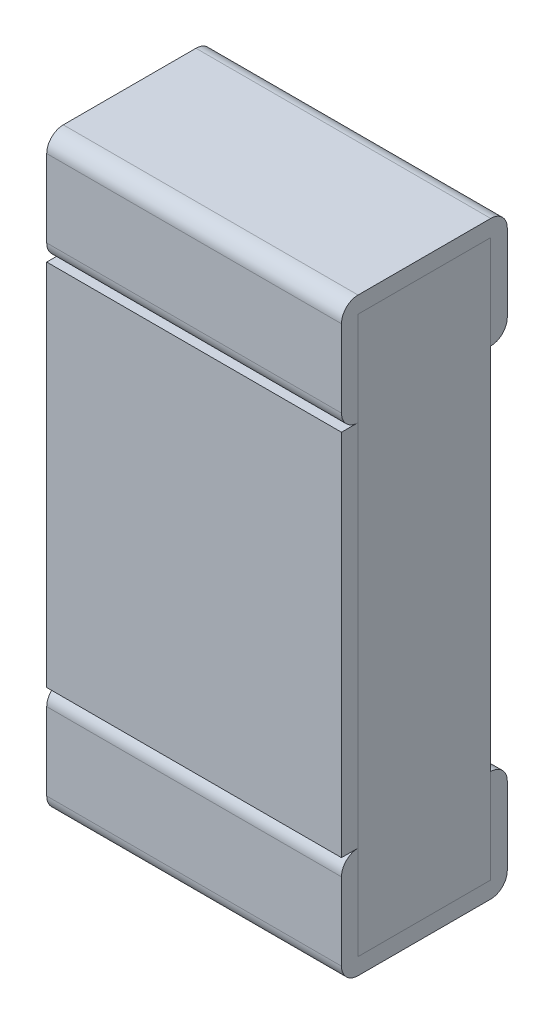
ISO-10303-21;
HEADER;
FILE_DESCRIPTION(('STEP AP214'),'2;1');
FILE_NAME('part.step','',(''),(''),'','','');
FILE_SCHEMA(('AUTOMOTIVE_DESIGN { 1 0 10303 214 1 1 1 1 }'));
ENDSEC;
DATA;
#1=APPLICATION_CONTEXT('core data for automotive mechanical design processes');
#2=APPLICATION_PROTOCOL_DEFINITION('international standard','automotive_design',2000,#1);
#3=PRODUCT_CONTEXT('',#1,'mechanical');
#4=PRODUCT('Part','Part','',(#3));
#5=PRODUCT_RELATED_PRODUCT_CATEGORY('part','',(#4));
#6=PRODUCT_DEFINITION_FORMATION('','',#4);
#7=PRODUCT_DEFINITION_CONTEXT('part definition',#1,'design');
#8=PRODUCT_DEFINITION('design','',#6,#7);
#9=PRODUCT_DEFINITION_SHAPE('','',#8);
#10=(LENGTH_UNIT() NAMED_UNIT(*) SI_UNIT(.MILLI.,.METRE.));
#11=(NAMED_UNIT(*) PLANE_ANGLE_UNIT() SI_UNIT($,.RADIAN.));
#12=(NAMED_UNIT(*) SI_UNIT($,.STERADIAN.) SOLID_ANGLE_UNIT());
#13=UNCERTAINTY_MEASURE_WITH_UNIT(LENGTH_MEASURE(1.E-05),#10,'distance_accuracy_value','');
#14=(GEOMETRIC_REPRESENTATION_CONTEXT(3) GLOBAL_UNCERTAINTY_ASSIGNED_CONTEXT((#13)) GLOBAL_UNIT_ASSIGNED_CONTEXT((#10,
#11,#12)) REPRESENTATION_CONTEXT('',''));
#15=CARTESIAN_POINT('',(0.,0.,0.));
#16=DIRECTION('',(0.,0.,1.));
#17=DIRECTION('',(1.,0.,0.));
#18=AXIS2_PLACEMENT_3D('',#15,#16,#17);
#19=CARTESIAN_POINT('',(120.998744279938,106.61004329235,142.661582908599));
#20=DIRECTION('',(0.,0.,1.));
#21=DIRECTION('',(1.,0.,0.));
#22=AXIS2_PLACEMENT_3D('',#19,#20,#21);
#23=PLANE('',#22);
#24=DIRECTION('',(1.,0.,0.));
#25=VECTOR('',#24,1.);
#26=CARTESIAN_POINT('',(120.998744279938,106.61004329235,142.661582908599));
#27=LINE('',#26,#25);
#28=CARTESIAN_POINT('',(120.998744279938,106.61004329235,142.661582908599));
#29=VERTEX_POINT('',#28);
#30=CARTESIAN_POINT('',(121.798744279938,106.61004329235,142.661582908599));
#31=VERTEX_POINT('',#30);
#32=EDGE_CURVE('E64',#29,#31,#27,.T.);
#33=ORIENTED_EDGE('',*,*,#32,.F.);
#34=DIRECTION('',(0.,-1.,0.));
#35=VECTOR('',#34,1.);
#36=CARTESIAN_POINT('',(120.998744279938,106.61004329235,142.661582908599));
#37=LINE('',#36,#35);
#38=CARTESIAN_POINT('',(120.998744279938,105.61004329235,142.661582908599));
#39=VERTEX_POINT('',#38);
#40=EDGE_CURVE('E11',#29,#39,#37,.T.);
#41=ORIENTED_EDGE('',*,*,#40,.T.);
#42=DIRECTION('',(1.,0.,0.));
#43=VECTOR('',#42,1.);
#44=CARTESIAN_POINT('',(120.998744279938,105.61004329235,142.661582908599));
#45=LINE('',#44,#43);
#46=CARTESIAN_POINT('',(121.798744279938,105.61004329235,142.661582908599));
#47=VERTEX_POINT('',#46);
#48=EDGE_CURVE('E54',#39,#47,#45,.T.);
#49=ORIENTED_EDGE('',*,*,#48,.T.);
#50=DIRECTION('',(0.,-1.,0.));
#51=VECTOR('',#50,1.);
#52=CARTESIAN_POINT('',(121.798744279938,106.61004329235,142.661582908599));
#53=LINE('',#52,#51);
#54=EDGE_CURVE('E344',#31,#47,#53,.T.);
#55=ORIENTED_EDGE('',*,*,#54,.F.);
#56=EDGE_LOOP('',(#33,#41,#49,#55));
#57=FACE_BOUND('',#56,.T.);
#58=ADVANCED_FACE('F44',(#57),#23,.T.);
#59=CARTESIAN_POINT('',(120.998744279938,105.61004329235,142.616582908599));
#60=DIRECTION('',(0.,-1.,0.));
#61=DIRECTION('',(0.,0.,-1.));
#62=AXIS2_PLACEMENT_3D('',#59,#60,#61);
#63=PLANE('',#62);
#64=DIRECTION('',(0.,0.,1.));
#65=VECTOR('',#64,1.);
#66=CARTESIAN_POINT('',(120.998744279938,105.61004329235,142.616582908599));
#67=LINE('',#66,#65);
#68=CARTESIAN_POINT('',(120.998744279938,105.61004329235,142.616582908599));
#69=VERTEX_POINT('',#68);
#70=EDGE_CURVE('E312',#69,#39,#67,.T.);
#71=ORIENTED_EDGE('',*,*,#70,.F.);
#72=DIRECTION('',(1.,0.,0.));
#73=VECTOR('',#72,1.);
#74=CARTESIAN_POINT('',(120.998744279938,105.61004329235,142.616582908599));
#75=LINE('',#74,#73);
#76=CARTESIAN_POINT('',(121.798744279938,105.61004329235,142.616582908599));
#77=VERTEX_POINT('',#76);
#78=EDGE_CURVE('E365',#69,#77,#75,.T.);
#79=ORIENTED_EDGE('',*,*,#78,.T.);
#80=DIRECTION('',(0.,0.,1.));
#81=VECTOR('',#80,1.);
#82=CARTESIAN_POINT('',(121.798744279938,105.61004329235,142.616582908599));
#83=LINE('',#82,#81);
#84=EDGE_CURVE('E280',#77,#47,#83,.T.);
#85=ORIENTED_EDGE('',*,*,#84,.T.);
#86=ORIENTED_EDGE('',*,*,#48,.F.);
#87=EDGE_LOOP('',(#71,#79,#85,#86));
#88=FACE_BOUND('',#87,.T.);
#89=ADVANCED_FACE('F549',(#88),#63,.T.);
#90=CARTESIAN_POINT('',(120.998744279938,105.56504329235,142.616582908599));
#91=DIRECTION('',(1.,0.,0.));
#92=DIRECTION('',(0.,1.,0.));
#93=AXIS2_PLACEMENT_3D('',#90,#91,#92);
#94=CYLINDRICAL_SURFACE('',#93,0.0450000000000034);
#95=CARTESIAN_POINT('',(120.998744279938,105.56504329235,142.616582908599));
#96=DIRECTION('',(1.,0.,0.));
#97=DIRECTION('',(0.,0.,1.));
#98=AXIS2_PLACEMENT_3D('',#95,#96,#97);
#99=CIRCLE('',#98,0.0449999999999895);
#100=CARTESIAN_POINT('',(120.998744279938,105.56504329235,142.661582908599));
#101=VERTEX_POINT('',#100);
#102=EDGE_CURVE('E379',#69,#101,#99,.T.);
#103=ORIENTED_EDGE('',*,*,#102,.T.);
#104=DIRECTION('',(1.,0.,0.));
#105=VECTOR('',#104,1.);
#106=CARTESIAN_POINT('',(120.998744279938,105.56504329235,142.661582908599));
#107=LINE('',#106,#105);
#108=CARTESIAN_POINT('',(121.798744279938,105.56504329235,142.661582908599));
#109=VERTEX_POINT('',#108);
#110=EDGE_CURVE('E376',#101,#109,#107,.T.);
#111=ORIENTED_EDGE('',*,*,#110,.T.);
#112=CARTESIAN_POINT('',(121.798744279938,105.56504329235,142.616582908599));
#113=DIRECTION('',(1.,0.,0.));
#114=DIRECTION('',(0.,0.,1.));
#115=AXIS2_PLACEMENT_3D('',#112,#113,#114);
#116=CIRCLE('',#115,0.0449999999999895);
#117=EDGE_CURVE('E248',#77,#109,#116,.T.);
#118=ORIENTED_EDGE('',*,*,#117,.F.);
#119=ORIENTED_EDGE('',*,*,#78,.F.);
#120=EDGE_LOOP('',(#103,#111,#118,#119));
#121=FACE_BOUND('',#120,.T.);
#122=ADVANCED_FACE('F547',(#121),#94,.T.);
#123=CARTESIAN_POINT('',(120.998744279938,105.61004329235,142.661582908599));
#124=DIRECTION('',(0.,0.,1.));
#125=DIRECTION('',(1.,0.,0.));
#126=AXIS2_PLACEMENT_3D('',#123,#124,#125);
#127=PLANE('',#126);
#128=DIRECTION('',(0.,-1.,0.));
#129=VECTOR('',#128,1.);
#130=CARTESIAN_POINT('',(121.798744279938,105.61004329235,142.661582908599));
#131=LINE('',#130,#129);
#132=CARTESIAN_POINT('',(121.798744279938,105.35504329235,142.661582908599));
#133=VERTEX_POINT('',#132);
#134=EDGE_CURVE('E240',#109,#133,#131,.T.);
#135=ORIENTED_EDGE('',*,*,#134,.F.);
#136=ORIENTED_EDGE('',*,*,#110,.F.);
#137=DIRECTION('',(0.,-1.,0.));
#138=VECTOR('',#137,1.);
#139=CARTESIAN_POINT('',(120.998744279938,105.61004329235,142.661582908599));
#140=LINE('',#139,#138);
#141=CARTESIAN_POINT('',(120.998744279938,105.35504329235,142.661582908599));
#142=VERTEX_POINT('',#141);
#143=EDGE_CURVE('E257',#101,#142,#140,.T.);
#144=ORIENTED_EDGE('',*,*,#143,.T.);
#145=DIRECTION('',(1.,0.,0.));
#146=VECTOR('',#145,1.);
#147=CARTESIAN_POINT('',(120.998744279938,105.35504329235,142.661582908599));
#148=LINE('',#147,#146);
#149=EDGE_CURVE('E254',#142,#133,#148,.T.);
#150=ORIENTED_EDGE('',*,*,#149,.T.);
#151=EDGE_LOOP('',(#135,#136,#144,#150));
#152=FACE_BOUND('',#151,.T.);
#153=ADVANCED_FACE('F255',(#152),#127,.T.);
#154=CARTESIAN_POINT('',(120.998744279938,105.35504329235,142.616582908599));
#155=DIRECTION('',(1.,0.,0.));
#156=DIRECTION('',(0.,-1.,0.));
#157=AXIS2_PLACEMENT_3D('',#154,#155,#156);
#158=CYLINDRICAL_SURFACE('',#157,0.0450000000000034);
#159=DIRECTION('',(1.,0.,0.));
#160=VECTOR('',#159,1.);
#161=CARTESIAN_POINT('',(120.998744279938,105.31004329235,142.616582908599));
#162=LINE('',#161,#160);
#163=CARTESIAN_POINT('',(120.998744279938,105.31004329235,142.616582908599));
#164=VERTEX_POINT('',#163);
#165=CARTESIAN_POINT('',(121.798744279938,105.31004329235,142.616582908599));
#166=VERTEX_POINT('',#165);
#167=EDGE_CURVE('E261',#164,#166,#162,.T.);
#168=ORIENTED_EDGE('',*,*,#167,.T.);
#169=CARTESIAN_POINT('',(121.798744279938,105.35504329235,142.616582908599));
#170=DIRECTION('',(-1.,0.,0.));
#171=DIRECTION('',(0.,0.,1.));
#172=AXIS2_PLACEMENT_3D('',#169,#170,#171);
#173=CIRCLE('',#172,0.0449999999999895);
#174=EDGE_CURVE('E244',#166,#133,#173,.T.);
#175=ORIENTED_EDGE('',*,*,#174,.T.);
#176=ORIENTED_EDGE('',*,*,#149,.F.);
#177=CARTESIAN_POINT('',(120.998744279938,105.35504329235,142.616582908599));
#178=DIRECTION('',(-1.,0.,0.));
#179=DIRECTION('',(0.,0.,1.));
#180=AXIS2_PLACEMENT_3D('',#177,#178,#179);
#181=CIRCLE('',#180,0.0449999999999895);
#182=EDGE_CURVE('E303',#164,#142,#181,.T.);
#183=ORIENTED_EDGE('',*,*,#182,.F.);
#184=EDGE_LOOP('',(#168,#175,#176,#183));
#185=FACE_BOUND('',#184,.T.);
#186=ADVANCED_FACE('F263',(#185),#158,.T.);
#187=CARTESIAN_POINT('',(120.998744279938,105.31004329235,142.211582908599));
#188=DIRECTION('',(0.,-1.,0.));
#189=DIRECTION('',(0.,0.,-1.));
#190=AXIS2_PLACEMENT_3D('',#187,#188,#189);
#191=PLANE('',#190);
#192=DIRECTION('',(0.,0.,1.));
#193=VECTOR('',#192,1.);
#194=CARTESIAN_POINT('',(120.998744279938,105.31004329235,142.211582908599));
#195=LINE('',#194,#193);
#196=CARTESIAN_POINT('',(120.998744279938,105.31004329235,142.256582908599));
#197=VERTEX_POINT('',#196);
#198=EDGE_CURVE('E298',#197,#164,#195,.T.);
#199=ORIENTED_EDGE('',*,*,#198,.F.);
#200=DIRECTION('',(1.,0.,0.));
#201=VECTOR('',#200,1.);
#202=CARTESIAN_POINT('',(120.998744279938,105.31004329235,142.256582908599));
#203=LINE('',#202,#201);
#204=CARTESIAN_POINT('',(121.798744279938,105.31004329235,142.256582908599));
#205=VERTEX_POINT('',#204);
#206=EDGE_CURVE('E267',#197,#205,#203,.T.);
#207=ORIENTED_EDGE('',*,*,#206,.T.);
#208=DIRECTION('',(0.,0.,1.));
#209=VECTOR('',#208,1.);
#210=CARTESIAN_POINT('',(121.798744279938,105.31004329235,142.211582908599));
#211=LINE('',#210,#209);
#212=EDGE_CURVE('E276',#205,#166,#211,.T.);
#213=ORIENTED_EDGE('',*,*,#212,.T.);
#214=ORIENTED_EDGE('',*,*,#167,.F.);
#215=EDGE_LOOP('',(#199,#207,#213,#214));
#216=FACE_BOUND('',#215,.T.);
#217=ADVANCED_FACE('F606',(#216),#191,.T.);
#218=CARTESIAN_POINT('',(120.998744279938,105.35504329235,142.256582908599));
#219=DIRECTION('',(1.,0.,0.));
#220=DIRECTION('',(0.,-1.,0.));
#221=AXIS2_PLACEMENT_3D('',#218,#219,#220);
#222=CYLINDRICAL_SURFACE('',#221,0.0450000000000034);
#223=CARTESIAN_POINT('',(120.998744279938,105.35504329235,142.256582908599));
#224=DIRECTION('',(1.,0.,0.));
#225=DIRECTION('',(0.,0.,1.));
#226=AXIS2_PLACEMENT_3D('',#223,#224,#225);
#227=CIRCLE('',#226,0.0449999999999895);
#228=CARTESIAN_POINT('',(120.998744279938,105.35504329235,142.211582908599));
#229=VERTEX_POINT('',#228);
#230=EDGE_CURVE('E48',#197,#229,#227,.T.);
#231=ORIENTED_EDGE('',*,*,#230,.T.);
#232=DIRECTION('',(1.,0.,0.));
#233=VECTOR('',#232,1.);
#234=CARTESIAN_POINT('',(120.998744279938,105.35504329235,142.211582908599));
#235=LINE('',#234,#233);
#236=CARTESIAN_POINT('',(121.798744279938,105.35504329235,142.211582908599));
#237=VERTEX_POINT('',#236);
#238=EDGE_CURVE('E178',#229,#237,#235,.T.);
#239=ORIENTED_EDGE('',*,*,#238,.T.);
#240=CARTESIAN_POINT('',(121.798744279938,105.35504329235,142.256582908599));
#241=DIRECTION('',(1.,0.,0.));
#242=DIRECTION('',(0.,0.,1.));
#243=AXIS2_PLACEMENT_3D('',#240,#241,#242);
#244=CIRCLE('',#243,0.0449999999999895);
#245=EDGE_CURVE('E192',#205,#237,#244,.T.);
#246=ORIENTED_EDGE('',*,*,#245,.F.);
#247=ORIENTED_EDGE('',*,*,#206,.F.);
#248=EDGE_LOOP('',(#231,#239,#246,#247));
#249=FACE_BOUND('',#248,.T.);
#250=ADVANCED_FACE('F604',(#249),#222,.T.);
#251=CARTESIAN_POINT('',(120.998744279938,105.61004329235,142.211582908599));
#252=DIRECTION('',(0.,0.,1.));
#253=DIRECTION('',(1.,0.,0.));
#254=AXIS2_PLACEMENT_3D('',#251,#252,#253);
#255=PLANE('',#254);
#256=ORIENTED_EDGE('',*,*,#238,.F.);
#257=DIRECTION('',(0.,-1.,0.));
#258=VECTOR('',#257,1.);
#259=CARTESIAN_POINT('',(120.998744279938,105.61004329235,142.211582908599));
#260=LINE('',#259,#258);
#261=CARTESIAN_POINT('',(120.998744279938,105.56504329235,142.211582908599));
#262=VERTEX_POINT('',#261);
#263=EDGE_CURVE('E433',#262,#229,#260,.T.);
#264=ORIENTED_EDGE('',*,*,#263,.F.);
#265=DIRECTION('',(1.,0.,0.));
#266=VECTOR('',#265,1.);
#267=CARTESIAN_POINT('',(120.998744279938,105.56504329235,142.211582908599));
#268=LINE('',#267,#266);
#269=CARTESIAN_POINT('',(121.798744279938,105.56504329235,142.211582908599));
#270=VERTEX_POINT('',#269);
#271=EDGE_CURVE('E326',#262,#270,#268,.T.);
#272=ORIENTED_EDGE('',*,*,#271,.T.);
#273=DIRECTION('',(0.,-1.,0.));
#274=VECTOR('',#273,1.);
#275=CARTESIAN_POINT('',(121.798744279938,105.61004329235,142.211582908599));
#276=LINE('',#275,#274);
#277=EDGE_CURVE('E330',#270,#237,#276,.T.);
#278=ORIENTED_EDGE('',*,*,#277,.T.);
#279=EDGE_LOOP('',(#256,#264,#272,#278));
#280=FACE_BOUND('',#279,.T.);
#281=ADVANCED_FACE('F539',(#280),#255,.F.);
#282=CARTESIAN_POINT('',(120.998744279938,105.56504329235,142.256582908599));
#283=DIRECTION('',(1.,0.,0.));
#284=DIRECTION('',(0.,1.,0.));
#285=AXIS2_PLACEMENT_3D('',#282,#283,#284);
#286=CYLINDRICAL_SURFACE('',#285,0.0450000000000034);
#287=DIRECTION('',(1.,0.,0.));
#288=VECTOR('',#287,1.);
#289=CARTESIAN_POINT('',(120.998744279938,105.61004329235,142.256582908599));
#290=LINE('',#289,#288);
#291=CARTESIAN_POINT('',(120.998744279938,105.61004329235,142.256582908599));
#292=VERTEX_POINT('',#291);
#293=CARTESIAN_POINT('',(121.798744279938,105.61004329235,142.256582908599));
#294=VERTEX_POINT('',#293);
#295=EDGE_CURVE('E373',#292,#294,#290,.T.);
#296=ORIENTED_EDGE('',*,*,#295,.T.);
#297=CARTESIAN_POINT('',(121.798744279938,105.56504329235,142.256582908599));
#298=DIRECTION('',(-1.,0.,0.));
#299=DIRECTION('',(0.,0.,1.));
#300=AXIS2_PLACEMENT_3D('',#297,#298,#299);
#301=CIRCLE('',#300,0.0449999999999895);
#302=EDGE_CURVE('E369',#294,#270,#301,.T.);
#303=ORIENTED_EDGE('',*,*,#302,.T.);
#304=ORIENTED_EDGE('',*,*,#271,.F.);
#305=CARTESIAN_POINT('',(120.998744279938,105.56504329235,142.256582908599));
#306=DIRECTION('',(-1.,0.,0.));
#307=DIRECTION('',(0.,0.,1.));
#308=AXIS2_PLACEMENT_3D('',#305,#306,#307);
#309=CIRCLE('',#308,0.0449999999999895);
#310=EDGE_CURVE('E356',#292,#262,#309,.T.);
#311=ORIENTED_EDGE('',*,*,#310,.F.);
#312=EDGE_LOOP('',(#296,#303,#304,#311));
#313=FACE_BOUND('',#312,.T.);
#314=ADVANCED_FACE('F532',(#313),#286,.T.);
#315=CARTESIAN_POINT('',(121.798744279938,106.61004329235,142.616582908599));
#316=DIRECTION('',(1.,0.,0.));
#317=DIRECTION('',(0.,1.,0.));
#318=AXIS2_PLACEMENT_3D('',#315,#316,#317);
#319=PLANE('',#318);
#320=DIRECTION('',(0.,-1.,0.));
#321=VECTOR('',#320,1.);
#322=CARTESIAN_POINT('',(121.798744279938,106.61004329235,142.616582908599));
#323=LINE('',#322,#321);
#324=CARTESIAN_POINT('',(121.798744279938,106.61004329235,142.616582908599));
#325=VERTEX_POINT('',#324);
#326=EDGE_CURVE('E340',#325,#77,#323,.T.);
#327=ORIENTED_EDGE('',*,*,#326,.F.);
#328=DIRECTION('',(0.,0.,1.));
#329=VECTOR('',#328,1.);
#330=CARTESIAN_POINT('',(121.798744279938,106.61004329235,142.616582908599));
#331=LINE('',#330,#329);
#332=EDGE_CURVE('E364',#325,#31,#331,.T.);
#333=ORIENTED_EDGE('',*,*,#332,.T.);
#334=ORIENTED_EDGE('',*,*,#54,.T.);
#335=ORIENTED_EDGE('',*,*,#84,.F.);
#336=EDGE_LOOP('',(#327,#333,#334,#335));
#337=FACE_BOUND('',#336,.T.);
#338=ADVANCED_FACE('F570',(#337),#319,.T.);
#339=CARTESIAN_POINT('',(121.798744279938,105.61004329235,142.211582908599));
#340=DIRECTION('',(1.,0.,0.));
#341=DIRECTION('',(0.,1.,0.));
#342=AXIS2_PLACEMENT_3D('',#339,#340,#341);
#343=PLANE('',#342);
#344=ORIENTED_EDGE('',*,*,#277,.F.);
#345=ORIENTED_EDGE('',*,*,#302,.F.);
#346=DIRECTION('',(0.,-1.,0.));
#347=VECTOR('',#346,1.);
#348=CARTESIAN_POINT('',(121.798744279938,106.86504329235,142.256582908599));
#349=LINE('',#348,#347);
#350=CARTESIAN_POINT('',(121.798744279938,105.35504329235,142.256582908599));
#351=VERTEX_POINT('',#350);
#352=EDGE_CURVE('E341',#294,#351,#349,.T.);
#353=ORIENTED_EDGE('',*,*,#352,.T.);
#354=DIRECTION('',(0.,0.,1.));
#355=VECTOR('',#354,1.);
#356=CARTESIAN_POINT('',(121.798744279938,105.35504329235,142.256582908599));
#357=LINE('',#356,#355);
#358=CARTESIAN_POINT('',(121.798744279938,105.35504329235,142.616582908599));
#359=VERTEX_POINT('',#358);
#360=EDGE_CURVE('E345',#351,#359,#357,.T.);
#361=ORIENTED_EDGE('',*,*,#360,.T.);
#362=DIRECTION('',(0.,-1.,0.));
#363=VECTOR('',#362,1.);
#364=CARTESIAN_POINT('',(121.798744279938,106.86504329235,142.616582908599));
#365=LINE('',#364,#363);
#366=EDGE_CURVE('E413',#77,#359,#365,.T.);
#367=ORIENTED_EDGE('',*,*,#366,.F.);
#368=ORIENTED_EDGE('',*,*,#117,.T.);
#369=ORIENTED_EDGE('',*,*,#134,.T.);
#370=ORIENTED_EDGE('',*,*,#174,.F.);
#371=ORIENTED_EDGE('',*,*,#212,.F.);
#372=ORIENTED_EDGE('',*,*,#245,.T.);
#373=EDGE_LOOP('',(#344,#345,#353,#361,#367,#368,#369,#370,#371,#372));
#374=FACE_BOUND('',#373,.T.);
#375=ADVANCED_FACE('F242',(#374),#343,.T.);
#376=CARTESIAN_POINT('',(120.998744279938,106.61004329235,142.616582908599));
#377=DIRECTION('',(0.,-1.,0.));
#378=DIRECTION('',(0.,0.,-1.));
#379=AXIS2_PLACEMENT_3D('',#376,#377,#378);
#380=PLANE('',#379);
#381=ORIENTED_EDGE('',*,*,#32,.T.);
#382=ORIENTED_EDGE('',*,*,#332,.F.);
#383=DIRECTION('',(1.,0.,0.));
#384=VECTOR('',#383,1.);
#385=CARTESIAN_POINT('',(120.998744279938,106.61004329235,142.616582908599));
#386=LINE('',#385,#384);
#387=CARTESIAN_POINT('',(120.998744279938,106.61004329235,142.616582908599));
#388=VERTEX_POINT('',#387);
#389=EDGE_CURVE('E417',#388,#325,#386,.T.);
#390=ORIENTED_EDGE('',*,*,#389,.F.);
#391=DIRECTION('',(0.,0.,1.));
#392=VECTOR('',#391,1.);
#393=CARTESIAN_POINT('',(120.998744279938,106.61004329235,142.616582908599));
#394=LINE('',#393,#392);
#395=EDGE_CURVE('E316',#388,#29,#394,.T.);
#396=ORIENTED_EDGE('',*,*,#395,.T.);
#397=EDGE_LOOP('',(#381,#382,#390,#396));
#398=FACE_BOUND('',#397,.T.);
#399=ADVANCED_FACE('F571',(#398),#380,.F.);
#400=CARTESIAN_POINT('',(120.998744279938,106.61004329235,142.616582908599));
#401=DIRECTION('',(1.,0.,0.));
#402=DIRECTION('',(0.,1.,0.));
#403=AXIS2_PLACEMENT_3D('',#400,#401,#402);
#404=PLANE('',#403);
#405=ORIENTED_EDGE('',*,*,#70,.T.);
#406=ORIENTED_EDGE('',*,*,#40,.F.);
#407=ORIENTED_EDGE('',*,*,#395,.F.);
#408=DIRECTION('',(0.,-1.,0.));
#409=VECTOR('',#408,1.);
#410=CARTESIAN_POINT('',(120.998744279938,106.61004329235,142.616582908599));
#411=LINE('',#410,#409);
#412=EDGE_CURVE('E302',#388,#69,#411,.T.);
#413=ORIENTED_EDGE('',*,*,#412,.T.);
#414=EDGE_LOOP('',(#405,#406,#407,#413));
#415=FACE_BOUND('',#414,.T.);
#416=ADVANCED_FACE('F573',(#415),#404,.F.);
#417=CARTESIAN_POINT('',(120.998744279938,105.61004329235,142.211582908599));
#418=DIRECTION('',(1.,0.,0.));
#419=DIRECTION('',(0.,1.,0.));
#420=AXIS2_PLACEMENT_3D('',#417,#418,#419);
#421=PLANE('',#420);
#422=ORIENTED_EDGE('',*,*,#230,.F.);
#423=ORIENTED_EDGE('',*,*,#198,.T.);
#424=ORIENTED_EDGE('',*,*,#182,.T.);
#425=ORIENTED_EDGE('',*,*,#143,.F.);
#426=ORIENTED_EDGE('',*,*,#102,.F.);
#427=DIRECTION('',(0.,-1.,0.));
#428=VECTOR('',#427,1.);
#429=CARTESIAN_POINT('',(120.998744279938,106.86504329235,142.616582908599));
#430=LINE('',#429,#428);
#431=CARTESIAN_POINT('',(120.998744279938,105.35504329235,142.616582908599));
#432=VERTEX_POINT('',#431);
#433=EDGE_CURVE('E353',#69,#432,#430,.T.);
#434=ORIENTED_EDGE('',*,*,#433,.T.);
#435=DIRECTION('',(0.,0.,1.));
#436=VECTOR('',#435,1.);
#437=CARTESIAN_POINT('',(120.998744279938,105.35504329235,142.256582908599));
#438=LINE('',#437,#436);
#439=CARTESIAN_POINT('',(120.998744279938,105.35504329235,142.256582908599));
#440=VERTEX_POINT('',#439);
#441=EDGE_CURVE('E307',#440,#432,#438,.T.);
#442=ORIENTED_EDGE('',*,*,#441,.F.);
#443=DIRECTION('',(0.,-1.,0.));
#444=VECTOR('',#443,1.);
#445=CARTESIAN_POINT('',(120.998744279938,106.86504329235,142.256582908599));
#446=LINE('',#445,#444);
#447=EDGE_CURVE('E311',#292,#440,#446,.T.);
#448=ORIENTED_EDGE('',*,*,#447,.F.);
#449=ORIENTED_EDGE('',*,*,#310,.T.);
#450=ORIENTED_EDGE('',*,*,#263,.T.);
#451=EDGE_LOOP('',(#422,#423,#424,#425,#426,#434,#442,#448,#449,#450));
#452=FACE_BOUND('',#451,.T.);
#453=ADVANCED_FACE('F540',(#452),#421,.F.);
#454=CARTESIAN_POINT('',(120.998744279938,106.86504329235,142.256582908599));
#455=DIRECTION('',(0.,0.,1.));
#456=DIRECTION('',(1.,0.,0.));
#457=AXIS2_PLACEMENT_3D('',#454,#455,#456);
#458=PLANE('',#457);
#459=DIRECTION('',(0.,-1.,0.));
#460=VECTOR('',#459,1.);
#461=CARTESIAN_POINT('',(121.798744279938,106.86504329235,142.256582908599));
#462=LINE('',#461,#460);
#463=CARTESIAN_POINT('',(121.798744279938,106.61004329235,142.256582908599));
#464=VERTEX_POINT('',#463);
#465=EDGE_CURVE('E398',#464,#294,#462,.T.);
#466=ORIENTED_EDGE('',*,*,#465,.T.);
#467=ORIENTED_EDGE('',*,*,#295,.F.);
#468=DIRECTION('',(0.,-1.,0.));
#469=VECTOR('',#468,1.);
#470=CARTESIAN_POINT('',(120.998744279938,106.86504329235,142.256582908599));
#471=LINE('',#470,#469);
#472=CARTESIAN_POINT('',(120.998744279938,106.61004329235,142.256582908599));
#473=VERTEX_POINT('',#472);
#474=EDGE_CURVE('E357',#473,#292,#471,.T.);
#475=ORIENTED_EDGE('',*,*,#474,.F.);
#476=DIRECTION('',(1.,0.,0.));
#477=VECTOR('',#476,1.);
#478=CARTESIAN_POINT('',(120.998744279938,106.61004329235,142.256582908599));
#479=LINE('',#478,#477);
#480=EDGE_CURVE('E395',#473,#464,#479,.T.);
#481=ORIENTED_EDGE('',*,*,#480,.T.);
#482=EDGE_LOOP('',(#466,#467,#475,#481));
#483=FACE_BOUND('',#482,.T.);
#484=ADVANCED_FACE('F526',(#483),#458,.F.);
#485=CARTESIAN_POINT('',(121.798744279938,106.86504329235,142.256582908599));
#486=DIRECTION('',(1.,0.,0.));
#487=DIRECTION('',(0.,1.,0.));
#488=AXIS2_PLACEMENT_3D('',#485,#486,#487);
#489=PLANE('',#488);
#490=DIRECTION('',(0.,-1.,0.));
#491=VECTOR('',#490,1.);
#492=CARTESIAN_POINT('',(121.798744279938,106.86504329235,142.256582908599));
#493=LINE('',#492,#491);
#494=CARTESIAN_POINT('',(121.798744279938,106.86504329235,142.256582908599));
#495=VERTEX_POINT('',#494);
#496=EDGE_CURVE('E127',#495,#464,#493,.T.);
#497=ORIENTED_EDGE('',*,*,#496,.F.);
#498=DIRECTION('',(0.,0.,1.));
#499=VECTOR('',#498,1.);
#500=CARTESIAN_POINT('',(121.798744279938,106.86504329235,142.256582908599));
#501=LINE('',#500,#499);
#502=CARTESIAN_POINT('',(121.798744279938,106.86504329235,142.616582908599));
#503=VERTEX_POINT('',#502);
#504=EDGE_CURVE('E339',#495,#503,#501,.T.);
#505=ORIENTED_EDGE('',*,*,#504,.T.);
#506=DIRECTION('',(0.,-1.,0.));
#507=VECTOR('',#506,1.);
#508=CARTESIAN_POINT('',(121.798744279938,106.86504329235,142.616582908599));
#509=LINE('',#508,#507);
#510=EDGE_CURVE('E335',#503,#325,#509,.T.);
#511=ORIENTED_EDGE('',*,*,#510,.T.);
#512=ORIENTED_EDGE('',*,*,#326,.T.);
#513=ORIENTED_EDGE('',*,*,#366,.T.);
#514=ORIENTED_EDGE('',*,*,#360,.F.);
#515=ORIENTED_EDGE('',*,*,#352,.F.);
#516=ORIENTED_EDGE('',*,*,#465,.F.);
#517=EDGE_LOOP('',(#497,#505,#511,#512,#513,#514,#515,#516));
#518=FACE_BOUND('',#517,.T.);
#519=ADVANCED_FACE('F538',(#518),#489,.T.);
#520=CARTESIAN_POINT('',(120.998744279938,106.65504329235,142.616582908599));
#521=DIRECTION('',(1.,0.,0.));
#522=DIRECTION('',(0.,-1.,0.));
#523=AXIS2_PLACEMENT_3D('',#520,#521,#522);
#524=CYLINDRICAL_SURFACE('',#523,0.0450000000000034);
#525=ORIENTED_EDGE('',*,*,#389,.T.);
#526=CARTESIAN_POINT('',(121.798744279938,106.65504329235,142.616582908599));
#527=DIRECTION('',(-1.,0.,0.));
#528=DIRECTION('',(0.,0.,1.));
#529=AXIS2_PLACEMENT_3D('',#526,#527,#528);
#530=CIRCLE('',#529,0.0449999999999895);
#531=CARTESIAN_POINT('',(121.798744279938,106.65504329235,142.661582908599));
#532=VERTEX_POINT('',#531);
#533=EDGE_CURVE('E418',#325,#532,#530,.T.);
#534=ORIENTED_EDGE('',*,*,#533,.T.);
#535=DIRECTION('',(1.,0.,0.));
#536=VECTOR('',#535,1.);
#537=CARTESIAN_POINT('',(120.998744279938,106.65504329235,142.661582908599));
#538=LINE('',#537,#536);
#539=CARTESIAN_POINT('',(120.998744279938,106.65504329235,142.661582908599));
#540=VERTEX_POINT('',#539);
#541=EDGE_CURVE('E361',#540,#532,#538,.T.);
#542=ORIENTED_EDGE('',*,*,#541,.F.);
#543=CARTESIAN_POINT('',(120.998744279938,106.65504329235,142.616582908599));
#544=DIRECTION('',(-1.,0.,0.));
#545=DIRECTION('',(0.,0.,1.));
#546=AXIS2_PLACEMENT_3D('',#543,#544,#545);
#547=CIRCLE('',#546,0.0449999999999895);
#548=EDGE_CURVE('E442',#388,#540,#547,.T.);
#549=ORIENTED_EDGE('',*,*,#548,.F.);
#550=EDGE_LOOP('',(#525,#534,#542,#549));
#551=FACE_BOUND('',#550,.T.);
#552=ADVANCED_FACE('F565',(#551),#524,.T.);
#553=CARTESIAN_POINT('',(120.998744279938,106.91004329235,142.661582908599));
#554=DIRECTION('',(0.,0.,1.));
#555=DIRECTION('',(1.,0.,0.));
#556=AXIS2_PLACEMENT_3D('',#553,#554,#555);
#557=PLANE('',#556);
#558=DIRECTION('',(0.,-1.,0.));
#559=VECTOR('',#558,1.);
#560=CARTESIAN_POINT('',(121.798744279938,106.91004329235,142.661582908599));
#561=LINE('',#560,#559);
#562=CARTESIAN_POINT('',(121.798744279938,106.86504329235,142.661582908599));
#563=VERTEX_POINT('',#562);
#564=EDGE_CURVE('E334',#563,#532,#561,.T.);
#565=ORIENTED_EDGE('',*,*,#564,.F.);
#566=DIRECTION('',(1.,0.,0.));
#567=VECTOR('',#566,1.);
#568=CARTESIAN_POINT('',(120.998744279938,106.86504329235,142.661582908599));
#569=LINE('',#568,#567);
#570=CARTESIAN_POINT('',(120.998744279938,106.86504329235,142.661582908599));
#571=VERTEX_POINT('',#570);
#572=EDGE_CURVE('E321',#571,#563,#569,.T.);
#573=ORIENTED_EDGE('',*,*,#572,.F.);
#574=DIRECTION('',(0.,-1.,0.));
#575=VECTOR('',#574,1.);
#576=CARTESIAN_POINT('',(120.998744279938,106.91004329235,142.661582908599));
#577=LINE('',#576,#575);
#578=EDGE_CURVE('E422',#571,#540,#577,.T.);
#579=ORIENTED_EDGE('',*,*,#578,.T.);
#580=ORIENTED_EDGE('',*,*,#541,.T.);
#581=EDGE_LOOP('',(#565,#573,#579,#580));
#582=FACE_BOUND('',#581,.T.);
#583=ADVANCED_FACE('F495',(#582),#557,.T.);
#584=CARTESIAN_POINT('',(120.998744279938,106.86504329235,142.256582908599));
#585=DIRECTION('',(1.,0.,0.));
#586=DIRECTION('',(0.,1.,0.));
#587=AXIS2_PLACEMENT_3D('',#584,#585,#586);
#588=PLANE('',#587);
#589=ORIENTED_EDGE('',*,*,#474,.T.);
#590=ORIENTED_EDGE('',*,*,#447,.T.);
#591=ORIENTED_EDGE('',*,*,#441,.T.);
#592=ORIENTED_EDGE('',*,*,#433,.F.);
#593=ORIENTED_EDGE('',*,*,#412,.F.);
#594=DIRECTION('',(0.,-1.,0.));
#595=VECTOR('',#594,1.);
#596=CARTESIAN_POINT('',(120.998744279938,106.86504329235,142.616582908599));
#597=LINE('',#596,#595);
#598=CARTESIAN_POINT('',(120.998744279938,106.86504329235,142.616582908599));
#599=VERTEX_POINT('',#598);
#600=EDGE_CURVE('E445',#599,#388,#597,.T.);
#601=ORIENTED_EDGE('',*,*,#600,.F.);
#602=DIRECTION('',(0.,0.,1.));
#603=VECTOR('',#602,1.);
#604=CARTESIAN_POINT('',(120.998744279938,106.86504329235,142.256582908599));
#605=LINE('',#604,#603);
#606=CARTESIAN_POINT('',(120.998744279938,106.86504329235,142.256582908599));
#607=VERTEX_POINT('',#606);
#608=EDGE_CURVE('E349',#607,#599,#605,.T.);
#609=ORIENTED_EDGE('',*,*,#608,.F.);
#610=DIRECTION('',(0.,-1.,0.));
#611=VECTOR('',#610,1.);
#612=CARTESIAN_POINT('',(120.998744279938,106.86504329235,142.256582908599));
#613=LINE('',#612,#611);
#614=EDGE_CURVE('E304',#607,#473,#613,.T.);
#615=ORIENTED_EDGE('',*,*,#614,.T.);
#616=EDGE_LOOP('',(#589,#590,#591,#592,#593,#601,#609,#615));
#617=FACE_BOUND('',#616,.T.);
#618=ADVANCED_FACE('F525',(#617),#588,.F.);
#619=CARTESIAN_POINT('',(120.998744279938,106.65504329235,142.256582908599));
#620=DIRECTION('',(1.,0.,0.));
#621=DIRECTION('',(0.,-1.,0.));
#622=AXIS2_PLACEMENT_3D('',#619,#620,#621);
#623=CYLINDRICAL_SURFACE('',#622,0.0450000000000034);
#624=CARTESIAN_POINT('',(120.998744279938,106.65504329235,142.256582908599));
#625=DIRECTION('',(1.,0.,0.));
#626=DIRECTION('',(0.,0.,1.));
#627=AXIS2_PLACEMENT_3D('',#624,#625,#626);
#628=CIRCLE('',#627,0.0449999999999895);
#629=CARTESIAN_POINT('',(120.998744279938,106.65504329235,142.211582908599));
#630=VERTEX_POINT('',#629);
#631=EDGE_CURVE('E285',#473,#630,#628,.T.);
#632=ORIENTED_EDGE('',*,*,#631,.T.);
#633=DIRECTION('',(1.,0.,0.));
#634=VECTOR('',#633,1.);
#635=CARTESIAN_POINT('',(120.998744279938,106.65504329235,142.211582908599));
#636=LINE('',#635,#634);
#637=CARTESIAN_POINT('',(121.798744279938,106.65504329235,142.211582908599));
#638=VERTEX_POINT('',#637);
#639=EDGE_CURVE('E282',#630,#638,#636,.T.);
#640=ORIENTED_EDGE('',*,*,#639,.T.);
#641=CARTESIAN_POINT('',(121.798744279938,106.65504329235,142.256582908599));
#642=DIRECTION('',(1.,0.,0.));
#643=DIRECTION('',(0.,0.,1.));
#644=AXIS2_PLACEMENT_3D('',#641,#642,#643);
#645=CIRCLE('',#644,0.0449999999999895);
#646=EDGE_CURVE('E439',#464,#638,#645,.T.);
#647=ORIENTED_EDGE('',*,*,#646,.F.);
#648=ORIENTED_EDGE('',*,*,#480,.F.);
#649=EDGE_LOOP('',(#632,#640,#647,#648));
#650=FACE_BOUND('',#649,.T.);
#651=ADVANCED_FACE('F517',(#650),#623,.T.);
#652=CARTESIAN_POINT('',(120.998744279938,106.91004329235,142.211582908599));
#653=DIRECTION('',(0.,0.,1.));
#654=DIRECTION('',(1.,0.,0.));
#655=AXIS2_PLACEMENT_3D('',#652,#653,#654);
#656=PLANE('',#655);
#657=ORIENTED_EDGE('',*,*,#639,.F.);
#658=DIRECTION('',(0.,-1.,0.));
#659=VECTOR('',#658,1.);
#660=CARTESIAN_POINT('',(120.998744279938,106.91004329235,142.211582908599));
#661=LINE('',#660,#659);
#662=CARTESIAN_POINT('',(120.998744279938,106.86504329235,142.211582908599));
#663=VERTEX_POINT('',#662);
#664=EDGE_CURVE('E409',#663,#630,#661,.T.);
#665=ORIENTED_EDGE('',*,*,#664,.F.);
#666=DIRECTION('',(1.,0.,0.));
#667=VECTOR('',#666,1.);
#668=CARTESIAN_POINT('',(120.998744279938,106.86504329235,142.211582908599));
#669=LINE('',#668,#667);
#670=CARTESIAN_POINT('',(121.798744279938,106.86504329235,142.211582908599));
#671=VERTEX_POINT('',#670);
#672=EDGE_CURVE('E286',#663,#671,#669,.T.);
#673=ORIENTED_EDGE('',*,*,#672,.T.);
#674=DIRECTION('',(0.,-1.,0.));
#675=VECTOR('',#674,1.);
#676=CARTESIAN_POINT('',(121.798744279938,106.91004329235,142.211582908599));
#677=LINE('',#676,#675);
#678=EDGE_CURVE('E291',#671,#638,#677,.T.);
#679=ORIENTED_EDGE('',*,*,#678,.T.);
#680=EDGE_LOOP('',(#657,#665,#673,#679));
#681=FACE_BOUND('',#680,.T.);
#682=ADVANCED_FACE('F513',(#681),#656,.F.);
#683=CARTESIAN_POINT('',(121.798744279938,106.91004329235,142.211582908599));
#684=DIRECTION('',(1.,0.,0.));
#685=DIRECTION('',(0.,1.,0.));
#686=AXIS2_PLACEMENT_3D('',#683,#684,#685);
#687=PLANE('',#686);
#688=ORIENTED_EDGE('',*,*,#678,.F.);
#689=CARTESIAN_POINT('',(121.798744279938,106.86504329235,142.256582908599));
#690=DIRECTION('',(-1.,0.,0.));
#691=DIRECTION('',(0.,0.,1.));
#692=AXIS2_PLACEMENT_3D('',#689,#690,#691);
#693=CIRCLE('',#692,0.0449999999999895);
#694=CARTESIAN_POINT('',(121.798744279938,106.91004329235,142.256582908599));
#695=VERTEX_POINT('',#694);
#696=EDGE_CURVE('E322',#695,#671,#693,.T.);
#697=ORIENTED_EDGE('',*,*,#696,.F.);
#698=DIRECTION('',(0.,0.,1.));
#699=VECTOR('',#698,1.);
#700=CARTESIAN_POINT('',(121.798744279938,106.91004329235,142.211582908599));
#701=LINE('',#700,#699);
#702=CARTESIAN_POINT('',(121.798744279938,106.91004329235,142.616582908599));
#703=VERTEX_POINT('',#702);
#704=EDGE_CURVE('E287',#695,#703,#701,.T.);
#705=ORIENTED_EDGE('',*,*,#704,.T.);
#706=CARTESIAN_POINT('',(121.798744279938,106.86504329235,142.616582908599));
#707=DIRECTION('',(1.,0.,0.));
#708=DIRECTION('',(0.,0.,1.));
#709=AXIS2_PLACEMENT_3D('',#706,#707,#708);
#710=CIRCLE('',#709,0.0449999999999895);
#711=EDGE_CURVE('E292',#703,#563,#710,.T.);
#712=ORIENTED_EDGE('',*,*,#711,.T.);
#713=ORIENTED_EDGE('',*,*,#564,.T.);
#714=ORIENTED_EDGE('',*,*,#533,.F.);
#715=ORIENTED_EDGE('',*,*,#510,.F.);
#716=ORIENTED_EDGE('',*,*,#504,.F.);
#717=ORIENTED_EDGE('',*,*,#496,.T.);
#718=ORIENTED_EDGE('',*,*,#646,.T.);
#719=EDGE_LOOP('',(#688,#697,#705,#712,#713,#714,#715,#716,#717,#718));
#720=FACE_BOUND('',#719,.T.);
#721=ADVANCED_FACE('F561',(#720),#687,.T.);
#722=CARTESIAN_POINT('',(120.998744279938,106.86504329235,142.616582908599));
#723=DIRECTION('',(1.,0.,0.));
#724=DIRECTION('',(0.,1.,0.));
#725=AXIS2_PLACEMENT_3D('',#722,#723,#724);
#726=CYLINDRICAL_SURFACE('',#725,0.0450000000000034);
#727=CARTESIAN_POINT('',(120.998744279938,106.86504329235,142.616582908599));
#728=DIRECTION('',(1.,0.,0.));
#729=DIRECTION('',(0.,0.,1.));
#730=AXIS2_PLACEMENT_3D('',#727,#728,#729);
#731=CIRCLE('',#730,0.0449999999999895);
#732=CARTESIAN_POINT('',(120.998744279938,106.91004329235,142.616582908599));
#733=VERTEX_POINT('',#732);
#734=EDGE_CURVE('E429',#733,#571,#731,.T.);
#735=ORIENTED_EDGE('',*,*,#734,.T.);
#736=ORIENTED_EDGE('',*,*,#572,.T.);
#737=ORIENTED_EDGE('',*,*,#711,.F.);
#738=DIRECTION('',(1.,0.,0.));
#739=VECTOR('',#738,1.);
#740=CARTESIAN_POINT('',(120.998744279938,106.91004329235,142.616582908599));
#741=LINE('',#740,#739);
#742=EDGE_CURVE('E297',#733,#703,#741,.T.);
#743=ORIENTED_EDGE('',*,*,#742,.F.);
#744=EDGE_LOOP('',(#735,#736,#737,#743));
#745=FACE_BOUND('',#744,.T.);
#746=ADVANCED_FACE('F503',(#745),#726,.T.);
#747=CARTESIAN_POINT('',(120.998744279938,106.86504329235,142.256582908599));
#748=DIRECTION('',(1.,0.,0.));
#749=DIRECTION('',(0.,1.,0.));
#750=AXIS2_PLACEMENT_3D('',#747,#748,#749);
#751=CYLINDRICAL_SURFACE('',#750,0.0450000000000034);
#752=DIRECTION('',(1.,0.,0.));
#753=VECTOR('',#752,1.);
#754=CARTESIAN_POINT('',(120.998744279938,106.91004329235,142.256582908599));
#755=LINE('',#754,#753);
#756=CARTESIAN_POINT('',(120.998744279938,106.91004329235,142.256582908599));
#757=VERTEX_POINT('',#756);
#758=EDGE_CURVE('E317',#757,#695,#755,.T.);
#759=ORIENTED_EDGE('',*,*,#758,.T.);
#760=ORIENTED_EDGE('',*,*,#696,.T.);
#761=ORIENTED_EDGE('',*,*,#672,.F.);
#762=CARTESIAN_POINT('',(120.998744279938,106.86504329235,142.256582908599));
#763=DIRECTION('',(-1.,0.,0.));
#764=DIRECTION('',(0.,0.,1.));
#765=AXIS2_PLACEMENT_3D('',#762,#763,#764);
#766=CIRCLE('',#765,0.0449999999999895);
#767=EDGE_CURVE('E426',#757,#663,#766,.T.);
#768=ORIENTED_EDGE('',*,*,#767,.F.);
#769=EDGE_LOOP('',(#759,#760,#761,#768));
#770=FACE_BOUND('',#769,.T.);
#771=ADVANCED_FACE('F46',(#770),#751,.T.);
#772=CARTESIAN_POINT('',(120.998744279938,106.91004329235,142.211582908599));
#773=DIRECTION('',(1.,0.,0.));
#774=DIRECTION('',(0.,1.,0.));
#775=AXIS2_PLACEMENT_3D('',#772,#773,#774);
#776=PLANE('',#775);
#777=ORIENTED_EDGE('',*,*,#631,.F.);
#778=ORIENTED_EDGE('',*,*,#614,.F.);
#779=ORIENTED_EDGE('',*,*,#608,.T.);
#780=ORIENTED_EDGE('',*,*,#600,.T.);
#781=ORIENTED_EDGE('',*,*,#548,.T.);
#782=ORIENTED_EDGE('',*,*,#578,.F.);
#783=ORIENTED_EDGE('',*,*,#734,.F.);
#784=DIRECTION('',(0.,0.,1.));
#785=VECTOR('',#784,1.);
#786=CARTESIAN_POINT('',(120.998744279938,106.91004329235,142.211582908599));
#787=LINE('',#786,#785);
#788=EDGE_CURVE('E293',#757,#733,#787,.T.);
#789=ORIENTED_EDGE('',*,*,#788,.F.);
#790=ORIENTED_EDGE('',*,*,#767,.T.);
#791=ORIENTED_EDGE('',*,*,#664,.T.);
#792=EDGE_LOOP('',(#777,#778,#779,#780,#781,#782,#783,#789,#790,#791));
#793=FACE_BOUND('',#792,.T.);
#794=ADVANCED_FACE('F500',(#793),#776,.F.);
#795=CARTESIAN_POINT('',(120.998744279938,106.91004329235,142.211582908599));
#796=DIRECTION('',(0.,-1.,0.));
#797=DIRECTION('',(0.,0.,-1.));
#798=AXIS2_PLACEMENT_3D('',#795,#796,#797);
#799=PLANE('',#798);
#800=ORIENTED_EDGE('',*,*,#742,.T.);
#801=ORIENTED_EDGE('',*,*,#704,.F.);
#802=ORIENTED_EDGE('',*,*,#758,.F.);
#803=ORIENTED_EDGE('',*,*,#788,.T.);
#804=EDGE_LOOP('',(#800,#801,#802,#803));
#805=FACE_BOUND('',#804,.T.);
#806=ADVANCED_FACE('F506',(#805),#799,.F.);
#807=CLOSED_SHELL('',(#58,#89,#122,#153,#186,#217,#250,#281,#314,#338,#375,#399,#416,#453,#484,
#519,#552,#583,#618,#651,#682,#721,#746,#771,#794,#806));
#808=MANIFOLD_SOLID_BREP('B2',#807);
#809=ADVANCED_BREP_SHAPE_REPRESENTATION('',(#18,#808),#14);
#810=SHAPE_DEFINITION_REPRESENTATION(#9,#809);
ENDSEC;
END-ISO-10303-21;
